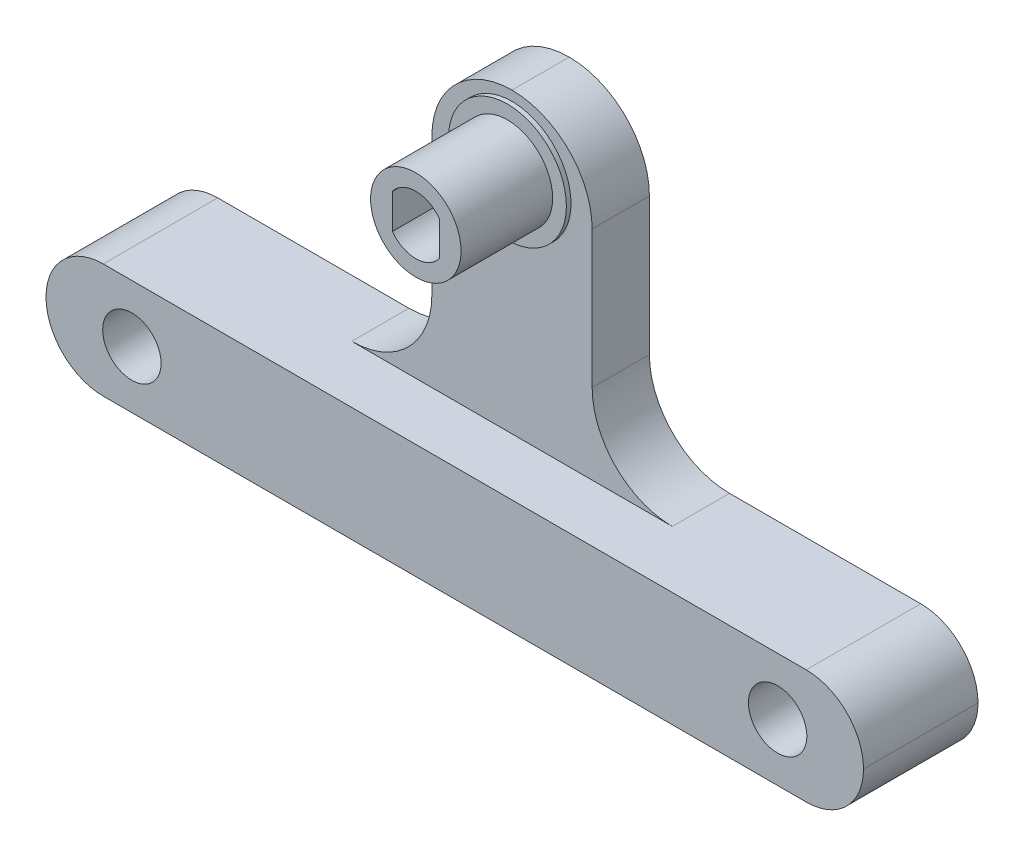
ISO-10303-21;
HEADER;
FILE_DESCRIPTION(('STEP AP214'),'2;1');
FILE_NAME('part.step','',(''),(''),'','','');
FILE_SCHEMA(('AUTOMOTIVE_DESIGN { 1 0 10303 214 1 1 1 1 }'));
ENDSEC;
DATA;
#1=APPLICATION_CONTEXT('core data for automotive mechanical design processes');
#2=APPLICATION_PROTOCOL_DEFINITION('international standard','automotive_design',2000,#1);
#3=PRODUCT_CONTEXT('',#1,'mechanical');
#4=PRODUCT('Part','Part','',(#3));
#5=PRODUCT_RELATED_PRODUCT_CATEGORY('part','',(#4));
#6=PRODUCT_DEFINITION_FORMATION('','',#4);
#7=PRODUCT_DEFINITION_CONTEXT('part definition',#1,'design');
#8=PRODUCT_DEFINITION('design','',#6,#7);
#9=PRODUCT_DEFINITION_SHAPE('','',#8);
#10=(LENGTH_UNIT() NAMED_UNIT(*) SI_UNIT(.MILLI.,.METRE.));
#11=(NAMED_UNIT(*) PLANE_ANGLE_UNIT() SI_UNIT($,.RADIAN.));
#12=(NAMED_UNIT(*) SI_UNIT($,.STERADIAN.) SOLID_ANGLE_UNIT());
#13=UNCERTAINTY_MEASURE_WITH_UNIT(LENGTH_MEASURE(1.E-05),#10,'distance_accuracy_value','');
#14=(GEOMETRIC_REPRESENTATION_CONTEXT(3) GLOBAL_UNCERTAINTY_ASSIGNED_CONTEXT((#13)) GLOBAL_UNIT_ASSIGNED_CONTEXT((#10,
#11,#12)) REPRESENTATION_CONTEXT('',''));
#15=CARTESIAN_POINT('',(0.,0.,0.));
#16=DIRECTION('',(0.,0.,1.));
#17=DIRECTION('',(1.,0.,0.));
#18=AXIS2_PLACEMENT_3D('',#15,#16,#17);
#19=CARTESIAN_POINT('',(0.,0.,-41.5));
#20=DIRECTION('',(0.,0.,-1.));
#21=DIRECTION('',(-1.,0.,0.));
#22=AXIS2_PLACEMENT_3D('',#19,#20,#21);
#23=PLANE('',#22);
#24=DIRECTION('',(0.,-1.,0.));
#25=VECTOR('',#24,1.);
#26=CARTESIAN_POINT('',(6.99999999999999,36.,-41.5));
#27=LINE('',#26,#25);
#28=CARTESIAN_POINT('',(6.99999999999999,29.,-41.5));
#29=VERTEX_POINT('',#28);
#30=CARTESIAN_POINT('',(6.99999999999999,17.,-41.5));
#31=VERTEX_POINT('',#30);
#32=EDGE_CURVE('E232',#29,#31,#27,.T.);
#33=ORIENTED_EDGE('',*,*,#32,.F.);
#34=CARTESIAN_POINT('',(0.,29.,-41.5));
#35=DIRECTION('',(0.,0.,-1.));
#36=DIRECTION('',(-1.,0.,0.));
#37=AXIS2_PLACEMENT_3D('',#34,#35,#36);
#38=CIRCLE('',#37,7.);
#39=CARTESIAN_POINT('',(0.,36.,-41.5));
#40=VERTEX_POINT('',#39);
#41=EDGE_CURVE('E276',#29,#40,#38,.F.);
#42=ORIENTED_EDGE('',*,*,#41,.T.);
#43=CARTESIAN_POINT('',(0.,29.,-41.5));
#44=DIRECTION('',(0.,0.,-1.));
#45=DIRECTION('',(-1.,0.,0.));
#46=AXIS2_PLACEMENT_3D('',#43,#44,#45);
#47=CIRCLE('',#46,7.);
#48=CARTESIAN_POINT('',(-7.00000000000001,29.,-41.5));
#49=VERTEX_POINT('',#48);
#50=EDGE_CURVE('E274',#40,#49,#47,.F.);
#51=ORIENTED_EDGE('',*,*,#50,.T.);
#52=DIRECTION('',(0.,1.,0.));
#53=VECTOR('',#52,1.);
#54=CARTESIAN_POINT('',(-7.,10.,-41.5));
#55=LINE('',#54,#53);
#56=CARTESIAN_POINT('',(-7.,17.,-41.5));
#57=VERTEX_POINT('',#56);
#58=EDGE_CURVE('E228',#57,#49,#55,.T.);
#59=ORIENTED_EDGE('',*,*,#58,.F.);
#60=CARTESIAN_POINT('',(-14.,17.,-41.5));
#61=DIRECTION('',(0.,0.,-1.));
#62=DIRECTION('',(-1.,0.,0.));
#63=AXIS2_PLACEMENT_3D('',#60,#61,#62);
#64=CIRCLE('',#63,7.);
#65=CARTESIAN_POINT('',(-14.,10.,-41.5));
#66=VERTEX_POINT('',#65);
#67=EDGE_CURVE('E285',#57,#66,#64,.T.);
#68=ORIENTED_EDGE('',*,*,#67,.T.);
#69=DIRECTION('',(-1.,0.,0.));
#70=VECTOR('',#69,1.);
#71=CARTESIAN_POINT('',(-7.,10.,-41.5));
#72=LINE('',#71,#70);
#73=CARTESIAN_POINT('',(14.,10.,-41.5));
#74=VERTEX_POINT('',#73);
#75=EDGE_CURVE('E226',#74,#66,#72,.T.);
#76=ORIENTED_EDGE('',*,*,#75,.F.);
#77=CARTESIAN_POINT('',(14.,17.,-41.5));
#78=DIRECTION('',(0.,0.,-1.));
#79=DIRECTION('',(-1.,0.,0.));
#80=AXIS2_PLACEMENT_3D('',#77,#78,#79);
#81=CIRCLE('',#80,7.);
#82=EDGE_CURVE('E281',#74,#31,#81,.T.);
#83=ORIENTED_EDGE('',*,*,#82,.T.);
#84=EDGE_LOOP('',(#33,#42,#51,#59,#68,#76,#83));
#85=FACE_BOUND('',#84,.T.);
#86=CARTESIAN_POINT('',(0.,30.,-41.5));
#87=DIRECTION('',(0.,0.,-1.));
#88=DIRECTION('',(-1.,0.,0.));
#89=AXIS2_PLACEMENT_3D('',#86,#87,#88);
#90=CIRCLE('',#89,5.15);
#91=CARTESIAN_POINT('',(-5.15000000000001,30.,-41.5));
#92=VERTEX_POINT('',#91);
#93=EDGE_CURVE('E248',#92,#92,#90,.F.);
#94=ORIENTED_EDGE('',*,*,#93,.F.);
#95=EDGE_LOOP('',(#94));
#96=FACE_BOUND('',#95,.T.);
#97=ADVANCED_FACE('F42',(#85,#96),#23,.F.);
#98=CARTESIAN_POINT('',(0.,10.,0.));
#99=DIRECTION('',(0.,1.,0.));
#100=DIRECTION('',(0.,0.,1.));
#101=AXIS2_PLACEMENT_3D('',#98,#99,#100);
#102=PLANE('',#101);
#103=DIRECTION('',(-1.,0.,0.));
#104=VECTOR('',#103,1.);
#105=CARTESIAN_POINT('',(-35.7,10.,-46.5));
#106=LINE('',#105,#104);
#107=CARTESIAN_POINT('',(-14.,10.,-46.5));
#108=VERTEX_POINT('',#107);
#109=CARTESIAN_POINT('',(-30.7,10.,-46.5));
#110=VERTEX_POINT('',#109);
#111=EDGE_CURVE('E249',#108,#110,#106,.T.);
#112=ORIENTED_EDGE('',*,*,#111,.T.);
#113=DIRECTION('',(0.,0.,1.));
#114=VECTOR('',#113,1.);
#115=CARTESIAN_POINT('',(-30.7,10.,-36.5));
#116=LINE('',#115,#114);
#117=CARTESIAN_POINT('',(-30.7,10.,-36.5));
#118=VERTEX_POINT('',#117);
#119=EDGE_CURVE('E297',#110,#118,#116,.T.);
#120=ORIENTED_EDGE('',*,*,#119,.T.);
#121=DIRECTION('',(-1.,0.,0.));
#122=VECTOR('',#121,1.);
#123=CARTESIAN_POINT('',(-25.7,10.,-36.5));
#124=LINE('',#123,#122);
#125=CARTESIAN_POINT('',(30.7,10.,-36.5));
#126=VERTEX_POINT('',#125);
#127=EDGE_CURVE('E240',#126,#118,#124,.T.);
#128=ORIENTED_EDGE('',*,*,#127,.F.);
#129=DIRECTION('',(0.,0.,-1.));
#130=VECTOR('',#129,1.);
#131=CARTESIAN_POINT('',(30.7,10.,-46.5));
#132=LINE('',#131,#130);
#133=CARTESIAN_POINT('',(30.7,10.,-46.5));
#134=VERTEX_POINT('',#133);
#135=EDGE_CURVE('E288',#126,#134,#132,.T.);
#136=ORIENTED_EDGE('',*,*,#135,.T.);
#137=CARTESIAN_POINT('',(14.,10.,-46.5));
#138=VERTEX_POINT('',#137);
#139=EDGE_CURVE('E246',#134,#138,#106,.T.);
#140=ORIENTED_EDGE('',*,*,#139,.T.);
#141=DIRECTION('',(0.,0.,-1.));
#142=VECTOR('',#141,1.);
#143=CARTESIAN_POINT('',(14.,10.,-41.5));
#144=LINE('',#143,#142);
#145=EDGE_CURVE('E263',#138,#74,#144,.F.);
#146=ORIENTED_EDGE('',*,*,#145,.T.);
#147=ORIENTED_EDGE('',*,*,#75,.T.);
#148=DIRECTION('',(0.,0.,-1.));
#149=VECTOR('',#148,1.);
#150=CARTESIAN_POINT('',(-14.,10.,-46.5));
#151=LINE('',#150,#149);
#152=EDGE_CURVE('E260',#66,#108,#151,.T.);
#153=ORIENTED_EDGE('',*,*,#152,.T.);
#154=EDGE_LOOP('',(#112,#120,#128,#136,#140,#146,#147,#153));
#155=FACE_BOUND('',#154,.T.);
#156=ADVANCED_FACE('F402',(#155),#102,.T.);
#157=CARTESIAN_POINT('',(0.,0.,0.));
#158=DIRECTION('',(0.,1.,0.));
#159=DIRECTION('',(0.,0.,1.));
#160=AXIS2_PLACEMENT_3D('',#157,#158,#159);
#161=PLANE('',#160);
#162=DIRECTION('',(-1.,0.,0.));
#163=VECTOR('',#162,1.);
#164=CARTESIAN_POINT('',(-25.7,0.,-36.5));
#165=LINE('',#164,#163);
#166=CARTESIAN_POINT('',(30.7,0.,-36.5));
#167=VERTEX_POINT('',#166);
#168=CARTESIAN_POINT('',(-30.7,0.,-36.5));
#169=VERTEX_POINT('',#168);
#170=EDGE_CURVE('E235',#167,#169,#165,.T.);
#171=ORIENTED_EDGE('',*,*,#170,.T.);
#172=DIRECTION('',(0.,0.,1.));
#173=VECTOR('',#172,1.);
#174=CARTESIAN_POINT('',(-30.7,0.,0.));
#175=LINE('',#174,#173);
#176=CARTESIAN_POINT('',(-30.7,0.,-46.5));
#177=VERTEX_POINT('',#176);
#178=EDGE_CURVE('E319',#169,#177,#175,.F.);
#179=ORIENTED_EDGE('',*,*,#178,.T.);
#180=DIRECTION('',(-1.,0.,0.));
#181=VECTOR('',#180,1.);
#182=CARTESIAN_POINT('',(-35.7,0.,-46.5));
#183=LINE('',#182,#181);
#184=CARTESIAN_POINT('',(30.7,0.,-46.5));
#185=VERTEX_POINT('',#184);
#186=EDGE_CURVE('E243',#185,#177,#183,.T.);
#187=ORIENTED_EDGE('',*,*,#186,.F.);
#188=DIRECTION('',(0.,0.,-1.));
#189=VECTOR('',#188,1.);
#190=CARTESIAN_POINT('',(30.7,0.,0.));
#191=LINE('',#190,#189);
#192=EDGE_CURVE('E316',#185,#167,#191,.F.);
#193=ORIENTED_EDGE('',*,*,#192,.T.);
#194=EDGE_LOOP('',(#171,#179,#187,#193));
#195=FACE_BOUND('',#194,.T.);
#196=ADVANCED_FACE('F408',(#195),#161,.F.);
#197=CARTESIAN_POINT('',(-35.7,10.,-46.5));
#198=DIRECTION('',(0.,0.,1.));
#199=DIRECTION('',(1.,0.,0.));
#200=AXIS2_PLACEMENT_3D('',#197,#198,#199);
#201=PLANE('',#200);
#202=CARTESIAN_POINT('',(0.,30.,-46.5));
#203=DIRECTION('',(0.,0.,1.));
#204=DIRECTION('',(1.,0.,0.));
#205=AXIS2_PLACEMENT_3D('',#202,#203,#204);
#206=CIRCLE('',#205,3.05);
#207=CARTESIAN_POINT('',(2.54999999999998,31.6733200530682,-46.5));
#208=VERTEX_POINT('',#207);
#209=CARTESIAN_POINT('',(-2.55000000000001,31.6733200530681,-46.5));
#210=VERTEX_POINT('',#209);
#211=EDGE_CURVE('E332',#208,#210,#206,.T.);
#212=ORIENTED_EDGE('',*,*,#211,.T.);
#213=DIRECTION('',(0.,-1.,0.));
#214=VECTOR('',#213,1.);
#215=CARTESIAN_POINT('',(-2.55000000000001,10.,-46.5));
#216=LINE('',#215,#214);
#217=CARTESIAN_POINT('',(-2.55000000000001,28.3266799469319,-46.5));
#218=VERTEX_POINT('',#217);
#219=EDGE_CURVE('E334',#210,#218,#216,.T.);
#220=ORIENTED_EDGE('',*,*,#219,.T.);
#221=CARTESIAN_POINT('',(0.,30.,-46.5));
#222=DIRECTION('',(0.,0.,1.));
#223=DIRECTION('',(1.,0.,0.));
#224=AXIS2_PLACEMENT_3D('',#221,#222,#223);
#225=CIRCLE('',#224,3.05);
#226=CARTESIAN_POINT('',(2.54999999999998,28.3266799469318,-46.5));
#227=VERTEX_POINT('',#226);
#228=EDGE_CURVE('E328',#218,#227,#225,.T.);
#229=ORIENTED_EDGE('',*,*,#228,.T.);
#230=DIRECTION('',(0.,1.,0.));
#231=VECTOR('',#230,1.);
#232=CARTESIAN_POINT('',(2.54999999999998,10.,-46.5));
#233=LINE('',#232,#231);
#234=EDGE_CURVE('E330',#227,#208,#233,.T.);
#235=ORIENTED_EDGE('',*,*,#234,.T.);
#236=EDGE_LOOP('',(#212,#220,#229,#235));
#237=FACE_BOUND('',#236,.T.);
#238=CARTESIAN_POINT('',(28.2,5.,-46.5));
#239=DIRECTION('',(0.,0.,-1.));
#240=DIRECTION('',(-1.,0.,0.));
#241=AXIS2_PLACEMENT_3D('',#238,#239,#240);
#242=CIRCLE('',#241,2.55);
#243=CARTESIAN_POINT('',(25.65,5.,-46.5));
#244=VERTEX_POINT('',#243);
#245=EDGE_CURVE('E207',#244,#244,#242,.T.);
#246=ORIENTED_EDGE('',*,*,#245,.F.);
#247=EDGE_LOOP('',(#246));
#248=FACE_BOUND('',#247,.T.);
#249=CARTESIAN_POINT('',(-28.2,5.,-46.5));
#250=DIRECTION('',(0.,0.,-1.));
#251=DIRECTION('',(-1.,0.,0.));
#252=AXIS2_PLACEMENT_3D('',#249,#250,#251);
#253=CIRCLE('',#252,2.55);
#254=CARTESIAN_POINT('',(-30.75,5.,-46.5));
#255=VERTEX_POINT('',#254);
#256=EDGE_CURVE('E211',#255,#255,#253,.T.);
#257=ORIENTED_EDGE('',*,*,#256,.F.);
#258=EDGE_LOOP('',(#257));
#259=FACE_BOUND('',#258,.T.);
#260=CARTESIAN_POINT('',(-30.7,5.,-46.5));
#261=DIRECTION('',(0.,0.,1.));
#262=DIRECTION('',(1.,0.,0.));
#263=AXIS2_PLACEMENT_3D('',#260,#261,#262);
#264=CIRCLE('',#263,5.);
#265=CARTESIAN_POINT('',(-35.7,5.,-46.5));
#266=VERTEX_POINT('',#265);
#267=EDGE_CURVE('E312',#177,#266,#264,.F.);
#268=ORIENTED_EDGE('',*,*,#267,.T.);
#269=CARTESIAN_POINT('',(-30.7,5.,-46.5));
#270=DIRECTION('',(0.,0.,1.));
#271=DIRECTION('',(1.,0.,0.));
#272=AXIS2_PLACEMENT_3D('',#269,#270,#271);
#273=CIRCLE('',#272,5.);
#274=EDGE_CURVE('E314',#266,#110,#273,.F.);
#275=ORIENTED_EDGE('',*,*,#274,.T.);
#276=ORIENTED_EDGE('',*,*,#111,.F.);
#277=CARTESIAN_POINT('',(-14.,17.,-46.5));
#278=DIRECTION('',(0.,0.,1.));
#279=DIRECTION('',(1.,0.,0.));
#280=AXIS2_PLACEMENT_3D('',#277,#278,#279);
#281=CIRCLE('',#280,7.);
#282=CARTESIAN_POINT('',(-7.00000000000001,17.,-46.5));
#283=VERTEX_POINT('',#282);
#284=EDGE_CURVE('E283',#108,#283,#281,.T.);
#285=ORIENTED_EDGE('',*,*,#284,.T.);
#286=DIRECTION('',(0.,1.,0.));
#287=VECTOR('',#286,1.);
#288=CARTESIAN_POINT('',(-7.,10.,-46.5));
#289=LINE('',#288,#287);
#290=CARTESIAN_POINT('',(-7.00000000000001,29.,-46.5));
#291=VERTEX_POINT('',#290);
#292=EDGE_CURVE('E225',#283,#291,#289,.T.);
#293=ORIENTED_EDGE('',*,*,#292,.T.);
#294=CARTESIAN_POINT('',(0.,29.,-46.5));
#295=DIRECTION('',(0.,0.,1.));
#296=DIRECTION('',(1.,0.,0.));
#297=AXIS2_PLACEMENT_3D('',#294,#295,#296);
#298=CIRCLE('',#297,7.);
#299=CARTESIAN_POINT('',(0.,36.,-46.5));
#300=VERTEX_POINT('',#299);
#301=EDGE_CURVE('E270',#291,#300,#298,.F.);
#302=ORIENTED_EDGE('',*,*,#301,.T.);
#303=CARTESIAN_POINT('',(0.,29.,-46.5));
#304=DIRECTION('',(0.,0.,1.));
#305=DIRECTION('',(1.,0.,0.));
#306=AXIS2_PLACEMENT_3D('',#303,#304,#305);
#307=CIRCLE('',#306,7.);
#308=CARTESIAN_POINT('',(6.99999999999999,29.,-46.5));
#309=VERTEX_POINT('',#308);
#310=EDGE_CURVE('E272',#300,#309,#307,.F.);
#311=ORIENTED_EDGE('',*,*,#310,.T.);
#312=DIRECTION('',(0.,-1.,0.));
#313=VECTOR('',#312,1.);
#314=CARTESIAN_POINT('',(6.99999999999999,36.,-46.5));
#315=LINE('',#314,#313);
#316=CARTESIAN_POINT('',(6.99999999999999,17.,-46.5));
#317=VERTEX_POINT('',#316);
#318=EDGE_CURVE('E229',#309,#317,#315,.T.);
#319=ORIENTED_EDGE('',*,*,#318,.T.);
#320=CARTESIAN_POINT('',(14.,17.,-46.5));
#321=DIRECTION('',(0.,0.,1.));
#322=DIRECTION('',(1.,0.,0.));
#323=AXIS2_PLACEMENT_3D('',#320,#321,#322);
#324=CIRCLE('',#323,7.);
#325=EDGE_CURVE('E278',#317,#138,#324,.T.);
#326=ORIENTED_EDGE('',*,*,#325,.T.);
#327=ORIENTED_EDGE('',*,*,#139,.F.);
#328=CARTESIAN_POINT('',(30.7,5.,-46.5));
#329=DIRECTION('',(0.,0.,1.));
#330=DIRECTION('',(1.,0.,0.));
#331=AXIS2_PLACEMENT_3D('',#328,#329,#330);
#332=CIRCLE('',#331,5.);
#333=CARTESIAN_POINT('',(35.7,5.,-46.5));
#334=VERTEX_POINT('',#333);
#335=EDGE_CURVE('E308',#134,#334,#332,.F.);
#336=ORIENTED_EDGE('',*,*,#335,.T.);
#337=CARTESIAN_POINT('',(30.7,5.,-46.5));
#338=DIRECTION('',(0.,0.,1.));
#339=DIRECTION('',(1.,0.,0.));
#340=AXIS2_PLACEMENT_3D('',#337,#338,#339);
#341=CIRCLE('',#340,5.);
#342=EDGE_CURVE('E310',#334,#185,#341,.F.);
#343=ORIENTED_EDGE('',*,*,#342,.T.);
#344=ORIENTED_EDGE('',*,*,#186,.T.);
#345=EDGE_LOOP('',(#268,#275,#276,#285,#293,#302,#311,#319,#326,#327,#336,#343,#344));
#346=FACE_BOUND('',#345,.T.);
#347=ADVANCED_FACE('F387',(#237,#248,#259,#346),#201,.F.);
#348=CARTESIAN_POINT('',(-25.7,10.,-36.5));
#349=DIRECTION('',(0.,0.,1.));
#350=DIRECTION('',(1.,0.,0.));
#351=AXIS2_PLACEMENT_3D('',#348,#349,#350);
#352=PLANE('',#351);
#353=CARTESIAN_POINT('',(28.2,5.,-36.5));
#354=DIRECTION('',(0.,0.,1.));
#355=DIRECTION('',(1.,0.,0.));
#356=AXIS2_PLACEMENT_3D('',#353,#354,#355);
#357=CIRCLE('',#356,2.55);
#358=CARTESIAN_POINT('',(25.65,5.,-36.5));
#359=VERTEX_POINT('',#358);
#360=EDGE_CURVE('E291',#359,#359,#357,.T.);
#361=ORIENTED_EDGE('',*,*,#360,.F.);
#362=EDGE_LOOP('',(#361));
#363=FACE_BOUND('',#362,.T.);
#364=CARTESIAN_POINT('',(-28.2,5.,-36.5));
#365=DIRECTION('',(0.,0.,1.));
#366=DIRECTION('',(1.,0.,0.));
#367=AXIS2_PLACEMENT_3D('',#364,#365,#366);
#368=CIRCLE('',#367,2.55);
#369=CARTESIAN_POINT('',(-30.75,5.,-36.5));
#370=VERTEX_POINT('',#369);
#371=EDGE_CURVE('E210',#370,#370,#368,.T.);
#372=ORIENTED_EDGE('',*,*,#371,.F.);
#373=EDGE_LOOP('',(#372));
#374=FACE_BOUND('',#373,.T.);
#375=ORIENTED_EDGE('',*,*,#127,.T.);
#376=CARTESIAN_POINT('',(-30.7,5.,-36.5));
#377=DIRECTION('',(0.,0.,1.));
#378=DIRECTION('',(1.,0.,0.));
#379=AXIS2_PLACEMENT_3D('',#376,#377,#378);
#380=CIRCLE('',#379,5.);
#381=CARTESIAN_POINT('',(-35.7,5.,-36.5));
#382=VERTEX_POINT('',#381);
#383=EDGE_CURVE('E306',#118,#382,#380,.T.);
#384=ORIENTED_EDGE('',*,*,#383,.T.);
#385=CARTESIAN_POINT('',(-30.7,5.,-36.5));
#386=DIRECTION('',(0.,0.,1.));
#387=DIRECTION('',(1.,0.,0.));
#388=AXIS2_PLACEMENT_3D('',#385,#386,#387);
#389=CIRCLE('',#388,5.);
#390=EDGE_CURVE('E304',#382,#169,#389,.T.);
#391=ORIENTED_EDGE('',*,*,#390,.T.);
#392=ORIENTED_EDGE('',*,*,#170,.F.);
#393=CARTESIAN_POINT('',(30.7,5.,-36.5));
#394=DIRECTION('',(0.,0.,1.));
#395=DIRECTION('',(1.,0.,0.));
#396=AXIS2_PLACEMENT_3D('',#393,#394,#395);
#397=CIRCLE('',#396,5.);
#398=CARTESIAN_POINT('',(35.7,5.,-36.5));
#399=VERTEX_POINT('',#398);
#400=EDGE_CURVE('E302',#167,#399,#397,.T.);
#401=ORIENTED_EDGE('',*,*,#400,.T.);
#402=CARTESIAN_POINT('',(30.7,5.,-36.5));
#403=DIRECTION('',(0.,0.,1.));
#404=DIRECTION('',(1.,0.,0.));
#405=AXIS2_PLACEMENT_3D('',#402,#403,#404);
#406=CIRCLE('',#405,5.);
#407=EDGE_CURVE('E300',#399,#126,#406,.T.);
#408=ORIENTED_EDGE('',*,*,#407,.T.);
#409=EDGE_LOOP('',(#375,#384,#391,#392,#401,#408));
#410=FACE_BOUND('',#409,.T.);
#411=ADVANCED_FACE('F421',(#363,#374,#410),#352,.T.);
#412=CARTESIAN_POINT('',(6.99999999999999,36.,-41.5));
#413=DIRECTION('',(1.,0.,0.));
#414=DIRECTION('',(0.,0.,-1.));
#415=AXIS2_PLACEMENT_3D('',#412,#413,#414);
#416=PLANE('',#415);
#417=ORIENTED_EDGE('',*,*,#32,.T.);
#418=DIRECTION('',(0.,0.,-1.));
#419=VECTOR('',#418,1.);
#420=CARTESIAN_POINT('',(6.99999999999999,17.,-46.5));
#421=LINE('',#420,#419);
#422=EDGE_CURVE('E257',#31,#317,#421,.T.);
#423=ORIENTED_EDGE('',*,*,#422,.T.);
#424=ORIENTED_EDGE('',*,*,#318,.F.);
#425=DIRECTION('',(0.,0.,-1.));
#426=VECTOR('',#425,1.);
#427=CARTESIAN_POINT('',(6.99999999999999,29.,-41.5));
#428=LINE('',#427,#426);
#429=EDGE_CURVE('E254',#309,#29,#428,.F.);
#430=ORIENTED_EDGE('',*,*,#429,.T.);
#431=EDGE_LOOP('',(#417,#423,#424,#430));
#432=FACE_BOUND('',#431,.T.);
#433=ADVANCED_FACE('F417',(#432),#416,.T.);
#434=CARTESIAN_POINT('',(-7.,10.,-41.5));
#435=DIRECTION('',(-1.,0.,0.));
#436=DIRECTION('',(0.,0.,1.));
#437=AXIS2_PLACEMENT_3D('',#434,#435,#436);
#438=PLANE('',#437);
#439=ORIENTED_EDGE('',*,*,#292,.F.);
#440=DIRECTION('',(0.,0.,-1.));
#441=VECTOR('',#440,1.);
#442=CARTESIAN_POINT('',(-7.,17.,-41.5));
#443=LINE('',#442,#441);
#444=EDGE_CURVE('E268',#283,#57,#443,.F.);
#445=ORIENTED_EDGE('',*,*,#444,.T.);
#446=ORIENTED_EDGE('',*,*,#58,.T.);
#447=DIRECTION('',(0.,0.,-1.));
#448=VECTOR('',#447,1.);
#449=CARTESIAN_POINT('',(-7.00000000000001,29.,-41.5));
#450=LINE('',#449,#448);
#451=EDGE_CURVE('E266',#49,#291,#450,.T.);
#452=ORIENTED_EDGE('',*,*,#451,.T.);
#453=EDGE_LOOP('',(#439,#445,#446,#452));
#454=FACE_BOUND('',#453,.T.);
#455=ADVANCED_FACE('F420',(#454),#438,.T.);
#456=CARTESIAN_POINT('',(0.,30.,-33.1));
#457=DIRECTION('',(0.,0.,1.));
#458=DIRECTION('',(1.,0.,0.));
#459=AXIS2_PLACEMENT_3D('',#456,#457,#458);
#460=PLANE('',#459);
#461=CARTESIAN_POINT('',(0.,30.,-33.1));
#462=DIRECTION('',(0.,0.,1.));
#463=DIRECTION('',(1.,0.,0.));
#464=AXIS2_PLACEMENT_3D('',#461,#462,#463);
#465=CIRCLE('',#464,3.95);
#466=CARTESIAN_POINT('',(3.94999999999999,30.,-33.1));
#467=VERTEX_POINT('',#466);
#468=EDGE_CURVE('E222',#467,#467,#465,.T.);
#469=ORIENTED_EDGE('',*,*,#468,.T.);
#470=EDGE_LOOP('',(#469));
#471=FACE_BOUND('',#470,.T.);
#472=DIRECTION('',(0.,1.,0.));
#473=VECTOR('',#472,1.);
#474=CARTESIAN_POINT('',(-2.05000000000001,28.4834249111897,-33.1));
#475=LINE('',#474,#473);
#476=CARTESIAN_POINT('',(-2.05000000000001,28.4834249111897,-33.1));
#477=VERTEX_POINT('',#476);
#478=CARTESIAN_POINT('',(-2.05000000000001,31.5165750888103,-33.1));
#479=VERTEX_POINT('',#478);
#480=EDGE_CURVE('E183',#477,#479,#475,.T.);
#481=ORIENTED_EDGE('',*,*,#480,.T.);
#482=CARTESIAN_POINT('',(0.,30.,-33.1));
#483=DIRECTION('',(0.,0.,1.));
#484=DIRECTION('',(1.,0.,0.));
#485=AXIS2_PLACEMENT_3D('',#482,#483,#484);
#486=CIRCLE('',#485,2.55);
#487=CARTESIAN_POINT('',(2.04999999999999,31.5165750888103,-33.1));
#488=VERTEX_POINT('',#487);
#489=EDGE_CURVE('E181',#479,#488,#486,.F.);
#490=ORIENTED_EDGE('',*,*,#489,.T.);
#491=DIRECTION('',(0.,-1.,0.));
#492=VECTOR('',#491,1.);
#493=CARTESIAN_POINT('',(2.04999999999999,31.5165750888103,-33.1));
#494=LINE('',#493,#492);
#495=CARTESIAN_POINT('',(2.04999999999999,28.4834249111897,-33.1));
#496=VERTEX_POINT('',#495);
#497=EDGE_CURVE('E187',#488,#496,#494,.T.);
#498=ORIENTED_EDGE('',*,*,#497,.T.);
#499=CARTESIAN_POINT('',(0.,30.,-33.1));
#500=DIRECTION('',(0.,0.,1.));
#501=DIRECTION('',(1.,0.,0.));
#502=AXIS2_PLACEMENT_3D('',#499,#500,#501);
#503=CIRCLE('',#502,2.55);
#504=EDGE_CURVE('E192',#496,#477,#503,.F.);
#505=ORIENTED_EDGE('',*,*,#504,.T.);
#506=EDGE_LOOP('',(#481,#490,#498,#505));
#507=FACE_BOUND('',#506,.T.);
#508=ADVANCED_FACE('F195',(#471,#507),#460,.T.);
#509=CARTESIAN_POINT('',(0.,30.,-33.1));
#510=DIRECTION('',(0.,0.,-1.));
#511=DIRECTION('',(-1.,0.,0.));
#512=AXIS2_PLACEMENT_3D('',#509,#510,#511);
#513=CYLINDRICAL_SURFACE('',#512,3.95);
#514=CARTESIAN_POINT('',(0.,30.,-41.1));
#515=DIRECTION('',(0.,0.,1.));
#516=DIRECTION('',(1.,0.,0.));
#517=AXIS2_PLACEMENT_3D('',#514,#515,#516);
#518=CIRCLE('',#517,3.95);
#519=CARTESIAN_POINT('',(3.94999999999999,30.,-41.1));
#520=VERTEX_POINT('',#519);
#521=EDGE_CURVE('E215',#520,#520,#518,.T.);
#522=ORIENTED_EDGE('',*,*,#521,.T.);
#523=EDGE_LOOP('',(#522));
#524=FACE_BOUND('',#523,.T.);
#525=ORIENTED_EDGE('',*,*,#468,.F.);
#526=EDGE_LOOP('',(#525));
#527=FACE_BOUND('',#526,.T.);
#528=ADVANCED_FACE('F415',(#524,#527),#513,.T.);
#529=CARTESIAN_POINT('',(0.,30.,-41.1));
#530=DIRECTION('',(0.,0.,1.));
#531=DIRECTION('',(1.,0.,0.));
#532=AXIS2_PLACEMENT_3D('',#529,#530,#531);
#533=PLANE('',#532);
#534=CARTESIAN_POINT('',(0.,30.,-41.1));
#535=DIRECTION('',(0.,0.,1.));
#536=DIRECTION('',(1.,0.,0.));
#537=AXIS2_PLACEMENT_3D('',#534,#535,#536);
#538=CIRCLE('',#537,5.15);
#539=CARTESIAN_POINT('',(5.14999999999999,30.,-41.1));
#540=VERTEX_POINT('',#539);
#541=EDGE_CURVE('E218',#540,#540,#538,.T.);
#542=ORIENTED_EDGE('',*,*,#541,.T.);
#543=EDGE_LOOP('',(#542));
#544=FACE_BOUND('',#543,.T.);
#545=ORIENTED_EDGE('',*,*,#521,.F.);
#546=EDGE_LOOP('',(#545));
#547=FACE_BOUND('',#546,.T.);
#548=ADVANCED_FACE('F652',(#544,#547),#533,.T.);
#549=CARTESIAN_POINT('',(0.,30.,-41.1));
#550=DIRECTION('',(0.,0.,-1.));
#551=DIRECTION('',(-1.,0.,0.));
#552=AXIS2_PLACEMENT_3D('',#549,#550,#551);
#553=CYLINDRICAL_SURFACE('',#552,5.15);
#554=ORIENTED_EDGE('',*,*,#541,.F.);
#555=EDGE_LOOP('',(#554));
#556=FACE_BOUND('',#555,.T.);
#557=ORIENTED_EDGE('',*,*,#93,.T.);
#558=EDGE_LOOP('',(#557));
#559=FACE_BOUND('',#558,.T.);
#560=ADVANCED_FACE('F438',(#556,#559),#553,.T.);
#561=CARTESIAN_POINT('',(14.,17.,-41.5));
#562=DIRECTION('',(0.,0.,1.));
#563=DIRECTION('',(1.,0.,0.));
#564=AXIS2_PLACEMENT_3D('',#561,#562,#563);
#565=CYLINDRICAL_SURFACE('',#564,7.);
#566=ORIENTED_EDGE('',*,*,#82,.F.);
#567=ORIENTED_EDGE('',*,*,#145,.F.);
#568=ORIENTED_EDGE('',*,*,#325,.F.);
#569=ORIENTED_EDGE('',*,*,#422,.F.);
#570=EDGE_LOOP('',(#566,#567,#568,#569));
#571=FACE_BOUND('',#570,.T.);
#572=ADVANCED_FACE('F434',(#571),#565,.F.);
#573=CARTESIAN_POINT('',(-14.,17.,0.));
#574=DIRECTION('',(0.,0.,1.));
#575=DIRECTION('',(1.,0.,0.));
#576=AXIS2_PLACEMENT_3D('',#573,#574,#575);
#577=CYLINDRICAL_SURFACE('',#576,7.);
#578=ORIENTED_EDGE('',*,*,#67,.F.);
#579=ORIENTED_EDGE('',*,*,#444,.F.);
#580=ORIENTED_EDGE('',*,*,#284,.F.);
#581=ORIENTED_EDGE('',*,*,#152,.F.);
#582=EDGE_LOOP('',(#578,#579,#580,#581));
#583=FACE_BOUND('',#582,.T.);
#584=ADVANCED_FACE('F437',(#583),#577,.F.);
#585=CARTESIAN_POINT('',(0.,29.,-41.5));
#586=DIRECTION('',(0.,0.,-1.));
#587=DIRECTION('',(-1.,0.,0.));
#588=AXIS2_PLACEMENT_3D('',#585,#586,#587);
#589=CYLINDRICAL_SURFACE('',#588,7.);
#590=ORIENTED_EDGE('',*,*,#451,.F.);
#591=ORIENTED_EDGE('',*,*,#50,.F.);
#592=DIRECTION('',(0.,0.,-1.));
#593=VECTOR('',#592,1.);
#594=CARTESIAN_POINT('',(0.,36.,-41.5));
#595=LINE('',#594,#593);
#596=EDGE_CURVE('E219',#300,#40,#595,.F.);
#597=ORIENTED_EDGE('',*,*,#596,.F.);
#598=ORIENTED_EDGE('',*,*,#301,.F.);
#599=EDGE_LOOP('',(#590,#591,#597,#598));
#600=FACE_BOUND('',#599,.T.);
#601=ADVANCED_FACE('F442',(#600),#589,.T.);
#602=CARTESIAN_POINT('',(0.,29.,-41.5));
#603=DIRECTION('',(0.,0.,-1.));
#604=DIRECTION('',(-1.,0.,0.));
#605=AXIS2_PLACEMENT_3D('',#602,#603,#604);
#606=CYLINDRICAL_SURFACE('',#605,7.);
#607=ORIENTED_EDGE('',*,*,#41,.F.);
#608=ORIENTED_EDGE('',*,*,#429,.F.);
#609=ORIENTED_EDGE('',*,*,#310,.F.);
#610=ORIENTED_EDGE('',*,*,#596,.T.);
#611=EDGE_LOOP('',(#607,#608,#609,#610));
#612=FACE_BOUND('',#611,.T.);
#613=ADVANCED_FACE('F444',(#612),#606,.T.);
#614=CARTESIAN_POINT('',(-28.2,5.,-33.1));
#615=DIRECTION('',(0.,0.,-1.));
#616=DIRECTION('',(-1.,0.,0.));
#617=AXIS2_PLACEMENT_3D('',#614,#615,#616);
#618=CYLINDRICAL_SURFACE('',#617,2.55);
#619=CARTESIAN_POINT('',(-30.75,5.,-36.5));
#620=CARTESIAN_POINT('',(-30.75,5.,-36.6041666666667));
#621=CARTESIAN_POINT('',(-30.75,5.,-36.7083333333333));
#622=CARTESIAN_POINT('',(-30.75,5.,-36.9166666666667));
#623=CARTESIAN_POINT('',(-30.75,5.,-37.0208333333333));
#624=CARTESIAN_POINT('',(-30.75,5.,-37.2291666666667));
#625=CARTESIAN_POINT('',(-30.75,5.,-37.3333333333333));
#626=CARTESIAN_POINT('',(-30.75,5.,-37.5416666666667));
#627=CARTESIAN_POINT('',(-30.75,5.,-37.6458333333333));
#628=CARTESIAN_POINT('',(-30.75,5.,-37.8541666666667));
#629=CARTESIAN_POINT('',(-30.75,5.,-37.9583333333333));
#630=CARTESIAN_POINT('',(-30.75,5.,-38.1666666666667));
#631=CARTESIAN_POINT('',(-30.75,5.,-38.2708333333333));
#632=CARTESIAN_POINT('',(-30.75,5.,-38.4791666666667));
#633=CARTESIAN_POINT('',(-30.75,5.,-38.5833333333333));
#634=CARTESIAN_POINT('',(-30.75,5.,-38.7916666666667));
#635=CARTESIAN_POINT('',(-30.75,5.,-38.8958333333333));
#636=CARTESIAN_POINT('',(-30.75,5.,-39.1041666666667));
#637=CARTESIAN_POINT('',(-30.75,5.,-39.2083333333333));
#638=CARTESIAN_POINT('',(-30.75,5.,-39.4166666666667));
#639=CARTESIAN_POINT('',(-30.75,5.,-39.5208333333333));
#640=CARTESIAN_POINT('',(-30.75,5.,-39.7291666666667));
#641=CARTESIAN_POINT('',(-30.75,5.,-39.8333333333333));
#642=CARTESIAN_POINT('',(-30.75,5.,-40.0416666666667));
#643=CARTESIAN_POINT('',(-30.75,5.,-40.1458333333333));
#644=CARTESIAN_POINT('',(-30.75,5.,-40.3541666666667));
#645=CARTESIAN_POINT('',(-30.75,5.,-40.4583333333333));
#646=CARTESIAN_POINT('',(-30.75,5.,-40.6666666666667));
#647=CARTESIAN_POINT('',(-30.75,5.,-40.7708333333333));
#648=CARTESIAN_POINT('',(-30.75,5.,-40.9791666666667));
#649=CARTESIAN_POINT('',(-30.75,5.,-41.0833333333333));
#650=CARTESIAN_POINT('',(-30.75,5.,-41.2916666666667));
#651=CARTESIAN_POINT('',(-30.75,5.,-41.3958333333333));
#652=CARTESIAN_POINT('',(-30.75,5.,-41.6041666666667));
#653=CARTESIAN_POINT('',(-30.75,5.,-41.7083333333333));
#654=CARTESIAN_POINT('',(-30.75,5.,-41.9166666666667));
#655=CARTESIAN_POINT('',(-30.75,5.,-42.0208333333333));
#656=CARTESIAN_POINT('',(-30.75,5.,-42.2291666666667));
#657=CARTESIAN_POINT('',(-30.75,5.,-42.3333333333333));
#658=CARTESIAN_POINT('',(-30.75,5.,-42.5416666666667));
#659=CARTESIAN_POINT('',(-30.75,5.,-42.6458333333333));
#660=CARTESIAN_POINT('',(-30.75,5.,-42.8541666666666));
#661=CARTESIAN_POINT('',(-30.75,5.,-42.9583333333333));
#662=CARTESIAN_POINT('',(-30.75,5.,-43.1666666666666));
#663=CARTESIAN_POINT('',(-30.75,5.,-43.2708333333333));
#664=CARTESIAN_POINT('',(-30.75,5.,-43.4791666666666));
#665=CARTESIAN_POINT('',(-30.75,5.,-43.5833333333333));
#666=CARTESIAN_POINT('',(-30.75,5.,-43.7916666666666));
#667=CARTESIAN_POINT('',(-30.75,5.,-43.8958333333333));
#668=CARTESIAN_POINT('',(-30.75,5.,-44.1041666666666));
#669=CARTESIAN_POINT('',(-30.75,5.,-44.2083333333333));
#670=CARTESIAN_POINT('',(-30.75,5.,-44.4166666666666));
#671=CARTESIAN_POINT('',(-30.75,5.,-44.5208333333333));
#672=CARTESIAN_POINT('',(-30.75,5.,-44.7291666666666));
#673=CARTESIAN_POINT('',(-30.75,5.,-44.8333333333333));
#674=CARTESIAN_POINT('',(-30.75,5.,-45.0416666666666));
#675=CARTESIAN_POINT('',(-30.75,5.,-45.1458333333333));
#676=CARTESIAN_POINT('',(-30.75,5.,-45.3541666666666));
#677=CARTESIAN_POINT('',(-30.75,5.,-45.4583333333333));
#678=CARTESIAN_POINT('',(-30.75,5.,-45.6666666666666));
#679=CARTESIAN_POINT('',(-30.75,5.,-45.7708333333333));
#680=CARTESIAN_POINT('',(-30.75,5.,-45.9791666666666));
#681=CARTESIAN_POINT('',(-30.75,5.,-46.0833333333333));
#682=CARTESIAN_POINT('',(-30.75,5.,-46.2916666666666));
#683=CARTESIAN_POINT('',(-30.75,5.,-46.3958333333333));
#684=CARTESIAN_POINT('',(-30.75,5.,-46.5));
#685=B_SPLINE_CURVE_WITH_KNOTS('',3,(#619,#620,#621,#622,#623,#624,#625,#626,#627,#628,#629,
#630,#631,#632,#633,#634,#635,#636,#637,#638,#639,#640,#641,#642,#643,#644,#645,#646,#647,#648,
#649,#650,#651,#652,#653,#654,#655,#656,#657,#658,#659,#660,#661,#662,#663,#664,#665,#666,#667,
#668,#669,#670,#671,#672,#673,#674,#675,#676,#677,#678,#679,#680,#681,#682,#683,#684),
.UNSPECIFIED.,.F.,.F.,(4,2,2,2,2,2,2,2,2,2,2,2,2,2,2,2,2,2,2,2,2,2,2,2,2,2,2,2,2,2,2,2,4),(0.,
0.3125,0.625000000000001,0.937500000000001,1.25,1.56249999999999,1.87499999999999,2.1875,2.5,
2.8125,3.125,3.43749999999999,3.74999999999999,4.06249999999999,4.37499999999999,
4.68749999999999,4.99999999999998,5.31249999999998,5.62499999999998,5.93749999999998,
6.24999999999998,6.56249999999998,6.87499999999998,7.18749999999998,7.49999999999998,
7.81249999999998,8.12499999999997,8.43749999999997,8.74999999999997,9.06249999999997,
9.37499999999997,9.68749999999997,9.99999999999997),.UNSPECIFIED.);
#686=EDGE_CURVE('BSEAM447',#370,#255,#685,.T.);
#687=ORIENTED_EDGE('',*,*,#371,.T.);
#688=ORIENTED_EDGE('',*,*,#256,.T.);
#689=ORIENTED_EDGE('',*,*,#686,.T.);
#690=ORIENTED_EDGE('',*,*,#686,.F.);
#691=EDGE_LOOP('',(#687,#689,#688,#690));
#692=FACE_BOUND('',#691,.T.);
#693=ADVANCED_FACE('F447',(#692),#618,.F.);
#694=CARTESIAN_POINT('',(28.2,5.,-33.1));
#695=DIRECTION('',(0.,0.,-1.));
#696=DIRECTION('',(-1.,0.,0.));
#697=AXIS2_PLACEMENT_3D('',#694,#695,#696);
#698=CYLINDRICAL_SURFACE('',#697,2.55);
#699=CARTESIAN_POINT('',(25.65,5.,-36.5));
#700=CARTESIAN_POINT('',(25.65,5.,-36.6041666666667));
#701=CARTESIAN_POINT('',(25.65,5.,-36.7083333333333));
#702=CARTESIAN_POINT('',(25.65,5.,-36.9166666666667));
#703=CARTESIAN_POINT('',(25.65,5.,-37.0208333333333));
#704=CARTESIAN_POINT('',(25.65,5.,-37.2291666666667));
#705=CARTESIAN_POINT('',(25.65,5.,-37.3333333333333));
#706=CARTESIAN_POINT('',(25.65,5.,-37.5416666666667));
#707=CARTESIAN_POINT('',(25.65,5.,-37.6458333333333));
#708=CARTESIAN_POINT('',(25.65,5.,-37.8541666666667));
#709=CARTESIAN_POINT('',(25.65,5.,-37.9583333333333));
#710=CARTESIAN_POINT('',(25.65,5.,-38.1666666666667));
#711=CARTESIAN_POINT('',(25.65,5.,-38.2708333333333));
#712=CARTESIAN_POINT('',(25.65,5.,-38.4791666666667));
#713=CARTESIAN_POINT('',(25.65,5.,-38.5833333333333));
#714=CARTESIAN_POINT('',(25.65,5.,-38.7916666666667));
#715=CARTESIAN_POINT('',(25.65,5.,-38.8958333333333));
#716=CARTESIAN_POINT('',(25.65,5.,-39.1041666666667));
#717=CARTESIAN_POINT('',(25.65,5.,-39.2083333333333));
#718=CARTESIAN_POINT('',(25.65,5.,-39.4166666666667));
#719=CARTESIAN_POINT('',(25.65,5.,-39.5208333333333));
#720=CARTESIAN_POINT('',(25.65,5.,-39.7291666666667));
#721=CARTESIAN_POINT('',(25.65,5.,-39.8333333333333));
#722=CARTESIAN_POINT('',(25.65,5.,-40.0416666666667));
#723=CARTESIAN_POINT('',(25.65,5.,-40.1458333333333));
#724=CARTESIAN_POINT('',(25.65,5.,-40.3541666666667));
#725=CARTESIAN_POINT('',(25.65,5.,-40.4583333333333));
#726=CARTESIAN_POINT('',(25.65,5.,-40.6666666666667));
#727=CARTESIAN_POINT('',(25.65,5.,-40.7708333333333));
#728=CARTESIAN_POINT('',(25.65,5.,-40.9791666666667));
#729=CARTESIAN_POINT('',(25.65,5.,-41.0833333333333));
#730=CARTESIAN_POINT('',(25.65,5.,-41.2916666666667));
#731=CARTESIAN_POINT('',(25.65,5.,-41.3958333333333));
#732=CARTESIAN_POINT('',(25.65,5.,-41.6041666666667));
#733=CARTESIAN_POINT('',(25.65,5.,-41.7083333333333));
#734=CARTESIAN_POINT('',(25.65,5.,-41.9166666666667));
#735=CARTESIAN_POINT('',(25.65,5.,-42.0208333333333));
#736=CARTESIAN_POINT('',(25.65,5.,-42.2291666666667));
#737=CARTESIAN_POINT('',(25.65,5.,-42.3333333333333));
#738=CARTESIAN_POINT('',(25.65,5.,-42.5416666666667));
#739=CARTESIAN_POINT('',(25.65,5.,-42.6458333333333));
#740=CARTESIAN_POINT('',(25.65,5.,-42.8541666666667));
#741=CARTESIAN_POINT('',(25.65,5.,-42.9583333333333));
#742=CARTESIAN_POINT('',(25.65,5.,-43.1666666666667));
#743=CARTESIAN_POINT('',(25.65,5.,-43.2708333333333));
#744=CARTESIAN_POINT('',(25.65,5.,-43.4791666666667));
#745=CARTESIAN_POINT('',(25.65,5.,-43.5833333333333));
#746=CARTESIAN_POINT('',(25.65,5.,-43.7916666666667));
#747=CARTESIAN_POINT('',(25.65,5.,-43.8958333333333));
#748=CARTESIAN_POINT('',(25.65,5.,-44.1041666666667));
#749=CARTESIAN_POINT('',(25.65,5.,-44.2083333333333));
#750=CARTESIAN_POINT('',(25.65,5.,-44.4166666666667));
#751=CARTESIAN_POINT('',(25.65,5.,-44.5208333333333));
#752=CARTESIAN_POINT('',(25.65,5.,-44.7291666666667));
#753=CARTESIAN_POINT('',(25.65,5.,-44.8333333333333));
#754=CARTESIAN_POINT('',(25.65,5.,-45.0416666666667));
#755=CARTESIAN_POINT('',(25.65,5.,-45.1458333333333));
#756=CARTESIAN_POINT('',(25.65,5.,-45.3541666666667));
#757=CARTESIAN_POINT('',(25.65,5.,-45.4583333333333));
#758=CARTESIAN_POINT('',(25.65,5.,-45.6666666666667));
#759=CARTESIAN_POINT('',(25.65,5.,-45.7708333333333));
#760=CARTESIAN_POINT('',(25.65,5.,-45.9791666666667));
#761=CARTESIAN_POINT('',(25.65,5.,-46.0833333333333));
#762=CARTESIAN_POINT('',(25.65,5.,-46.2916666666667));
#763=CARTESIAN_POINT('',(25.65,5.,-46.3958333333333));
#764=CARTESIAN_POINT('',(25.65,5.,-46.5));
#765=B_SPLINE_CURVE_WITH_KNOTS('',3,(#699,#700,#701,#702,#703,#704,#705,#706,#707,#708,#709,
#710,#711,#712,#713,#714,#715,#716,#717,#718,#719,#720,#721,#722,#723,#724,#725,#726,#727,#728,
#729,#730,#731,#732,#733,#734,#735,#736,#737,#738,#739,#740,#741,#742,#743,#744,#745,#746,#747,
#748,#749,#750,#751,#752,#753,#754,#755,#756,#757,#758,#759,#760,#761,#762,#763,#764),
.UNSPECIFIED.,.F.,.F.,(4,2,2,2,2,2,2,2,2,2,2,2,2,2,2,2,2,2,2,2,2,2,2,2,2,2,2,2,2,2,2,2,4),(0.,
0.3125,0.625000000000001,0.937500000000001,1.25,1.5625,1.875,2.1875,2.5,2.8125,3.125,3.4375,
3.75,4.0625,4.375,4.68749999999999,4.99999999999999,5.31249999999999,5.62499999999999,
5.93749999999999,6.24999999999999,6.56249999999999,6.87499999999998,7.18749999999999,
7.49999999999999,7.81249999999999,8.12499999999999,8.43749999999999,8.74999999999999,
9.06249999999999,9.37499999999999,9.68749999999998,9.99999999999998),.UNSPECIFIED.);
#766=EDGE_CURVE('BSEAM460',#359,#244,#765,.T.);
#767=ORIENTED_EDGE('',*,*,#360,.T.);
#768=ORIENTED_EDGE('',*,*,#245,.T.);
#769=ORIENTED_EDGE('',*,*,#766,.T.);
#770=ORIENTED_EDGE('',*,*,#766,.F.);
#771=EDGE_LOOP('',(#767,#769,#768,#770));
#772=FACE_BOUND('',#771,.T.);
#773=ADVANCED_FACE('F460',(#772),#698,.F.);
#774=CARTESIAN_POINT('',(-30.7,5.,-46.5));
#775=DIRECTION('',(0.,0.,1.));
#776=DIRECTION('',(1.,0.,0.));
#777=AXIS2_PLACEMENT_3D('',#774,#775,#776);
#778=CYLINDRICAL_SURFACE('',#777,5.);
#779=DIRECTION('',(0.,0.,1.));
#780=VECTOR('',#779,1.);
#781=CARTESIAN_POINT('',(-35.7,5.,-46.5));
#782=LINE('',#781,#780);
#783=EDGE_CURVE('E214',#266,#382,#782,.T.);
#784=ORIENTED_EDGE('',*,*,#783,.F.);
#785=ORIENTED_EDGE('',*,*,#267,.F.);
#786=ORIENTED_EDGE('',*,*,#178,.F.);
#787=ORIENTED_EDGE('',*,*,#390,.F.);
#788=EDGE_LOOP('',(#784,#785,#786,#787));
#789=FACE_BOUND('',#788,.T.);
#790=ADVANCED_FACE('F456',(#789),#778,.T.);
#791=CARTESIAN_POINT('',(-30.7,5.,0.));
#792=DIRECTION('',(0.,0.,-1.));
#793=DIRECTION('',(-1.,0.,0.));
#794=AXIS2_PLACEMENT_3D('',#791,#792,#793);
#795=CYLINDRICAL_SURFACE('',#794,5.);
#796=ORIENTED_EDGE('',*,*,#274,.F.);
#797=ORIENTED_EDGE('',*,*,#783,.T.);
#798=ORIENTED_EDGE('',*,*,#383,.F.);
#799=ORIENTED_EDGE('',*,*,#119,.F.);
#800=EDGE_LOOP('',(#796,#797,#798,#799));
#801=FACE_BOUND('',#800,.T.);
#802=ADVANCED_FACE('F452',(#801),#795,.T.);
#803=CARTESIAN_POINT('',(30.7,5.,0.));
#804=DIRECTION('',(0.,0.,1.));
#805=DIRECTION('',(1.,0.,0.));
#806=AXIS2_PLACEMENT_3D('',#803,#804,#805);
#807=CYLINDRICAL_SURFACE('',#806,5.);
#808=ORIENTED_EDGE('',*,*,#135,.F.);
#809=ORIENTED_EDGE('',*,*,#407,.F.);
#810=DIRECTION('',(0.,0.,-1.));
#811=VECTOR('',#810,1.);
#812=CARTESIAN_POINT('',(35.7,5.,-36.5));
#813=LINE('',#812,#811);
#814=EDGE_CURVE('E199',#334,#399,#813,.F.);
#815=ORIENTED_EDGE('',*,*,#814,.F.);
#816=ORIENTED_EDGE('',*,*,#335,.F.);
#817=EDGE_LOOP('',(#808,#809,#815,#816));
#818=FACE_BOUND('',#817,.T.);
#819=ADVANCED_FACE('F455',(#818),#807,.T.);
#820=CARTESIAN_POINT('',(30.7,5.,-46.5));
#821=DIRECTION('',(0.,0.,-1.));
#822=DIRECTION('',(-1.,0.,0.));
#823=AXIS2_PLACEMENT_3D('',#820,#821,#822);
#824=CYLINDRICAL_SURFACE('',#823,5.);
#825=ORIENTED_EDGE('',*,*,#400,.F.);
#826=ORIENTED_EDGE('',*,*,#192,.F.);
#827=ORIENTED_EDGE('',*,*,#342,.F.);
#828=ORIENTED_EDGE('',*,*,#814,.T.);
#829=EDGE_LOOP('',(#825,#826,#827,#828));
#830=FACE_BOUND('',#829,.T.);
#831=ADVANCED_FACE('F462',(#830),#824,.T.);
#832=CARTESIAN_POINT('',(0.,30.,-25.321825406948));
#833=DIRECTION('',(0.,0.,-1.));
#834=DIRECTION('',(-1.,0.,0.));
#835=AXIS2_PLACEMENT_3D('',#832,#833,#834);
#836=CYLINDRICAL_SURFACE('',#835,2.55);
#837=DIRECTION('',(0.,0.,-1.));
#838=VECTOR('',#837,1.);
#839=CARTESIAN_POINT('',(-2.05000000000001,31.5165750888103,-25.321825406948));
#840=LINE('',#839,#838);
#841=CARTESIAN_POINT('',(-2.05000000000001,31.5165750888103,-46.));
#842=VERTEX_POINT('',#841);
#843=EDGE_CURVE('E201',#479,#842,#840,.T.);
#844=ORIENTED_EDGE('',*,*,#843,.T.);
#845=CARTESIAN_POINT('',(0.,30.,-46.));
#846=DIRECTION('',(0.,0.,1.));
#847=DIRECTION('',(1.,0.,0.));
#848=AXIS2_PLACEMENT_3D('',#845,#846,#847);
#849=CIRCLE('',#848,2.55);
#850=CARTESIAN_POINT('',(2.04999999999999,31.5165750888103,-46.));
#851=VERTEX_POINT('',#850);
#852=EDGE_CURVE('E72',#842,#851,#849,.F.);
#853=ORIENTED_EDGE('',*,*,#852,.T.);
#854=DIRECTION('',(0.,0.,-1.));
#855=VECTOR('',#854,1.);
#856=CARTESIAN_POINT('',(2.04999999999999,31.5165750888103,-25.321825406948));
#857=LINE('',#856,#855);
#858=EDGE_CURVE('E177',#488,#851,#857,.T.);
#859=ORIENTED_EDGE('',*,*,#858,.F.);
#860=ORIENTED_EDGE('',*,*,#489,.F.);
#861=EDGE_LOOP('',(#844,#853,#859,#860));
#862=FACE_BOUND('',#861,.T.);
#863=ADVANCED_FACE('F179',(#862),#836,.F.);
#864=CARTESIAN_POINT('',(-2.05000000000001,28.4834249111897,-25.321825406948));
#865=DIRECTION('',(-1.,0.,0.));
#866=DIRECTION('',(0.,0.,1.));
#867=AXIS2_PLACEMENT_3D('',#864,#865,#866);
#868=PLANE('',#867);
#869=DIRECTION('',(0.,0.,-1.));
#870=VECTOR('',#869,1.);
#871=CARTESIAN_POINT('',(-2.05,28.4834249111897,-25.321825406948));
#872=LINE('',#871,#870);
#873=CARTESIAN_POINT('',(-2.05000000000001,28.4834249111897,-46.));
#874=VERTEX_POINT('',#873);
#875=EDGE_CURVE('E203',#477,#874,#872,.T.);
#876=ORIENTED_EDGE('',*,*,#875,.T.);
#877=DIRECTION('',(0.,1.,0.));
#878=VECTOR('',#877,1.);
#879=CARTESIAN_POINT('',(-2.05000000000001,28.4834249111897,-46.));
#880=LINE('',#879,#878);
#881=EDGE_CURVE('E321',#874,#842,#880,.T.);
#882=ORIENTED_EDGE('',*,*,#881,.T.);
#883=ORIENTED_EDGE('',*,*,#843,.F.);
#884=ORIENTED_EDGE('',*,*,#480,.F.);
#885=EDGE_LOOP('',(#876,#882,#883,#884));
#886=FACE_BOUND('',#885,.T.);
#887=ADVANCED_FACE('F390',(#886),#868,.F.);
#888=CARTESIAN_POINT('',(0.,30.,-25.321825406948));
#889=DIRECTION('',(0.,0.,-1.));
#890=DIRECTION('',(-1.,0.,0.));
#891=AXIS2_PLACEMENT_3D('',#888,#889,#890);
#892=CYLINDRICAL_SURFACE('',#891,2.55);
#893=DIRECTION('',(0.,0.,-1.));
#894=VECTOR('',#893,1.);
#895=CARTESIAN_POINT('',(2.04999999999999,28.4834249111897,-25.321825406948));
#896=LINE('',#895,#894);
#897=CARTESIAN_POINT('',(2.04999999999999,28.4834249111897,-46.));
#898=VERTEX_POINT('',#897);
#899=EDGE_CURVE('E184',#496,#898,#896,.T.);
#900=ORIENTED_EDGE('',*,*,#899,.T.);
#901=CARTESIAN_POINT('',(0.,30.,-46.));
#902=DIRECTION('',(0.,0.,1.));
#903=DIRECTION('',(1.,0.,0.));
#904=AXIS2_PLACEMENT_3D('',#901,#902,#903);
#905=CIRCLE('',#904,2.55);
#906=EDGE_CURVE('E11',#898,#874,#905,.F.);
#907=ORIENTED_EDGE('',*,*,#906,.T.);
#908=ORIENTED_EDGE('',*,*,#875,.F.);
#909=ORIENTED_EDGE('',*,*,#504,.F.);
#910=EDGE_LOOP('',(#900,#907,#908,#909));
#911=FACE_BOUND('',#910,.T.);
#912=ADVANCED_FACE('F393',(#911),#892,.F.);
#913=CARTESIAN_POINT('',(2.04999999999999,31.5165750888103,-25.321825406948));
#914=DIRECTION('',(1.,0.,0.));
#915=DIRECTION('',(0.,0.,-1.));
#916=AXIS2_PLACEMENT_3D('',#913,#914,#915);
#917=PLANE('',#916);
#918=ORIENTED_EDGE('',*,*,#858,.T.);
#919=DIRECTION('',(0.,-1.,0.));
#920=VECTOR('',#919,1.);
#921=CARTESIAN_POINT('',(2.04999999999999,31.5165750888103,-46.));
#922=LINE('',#921,#920);
#923=EDGE_CURVE('E57',#851,#898,#922,.T.);
#924=ORIENTED_EDGE('',*,*,#923,.T.);
#925=ORIENTED_EDGE('',*,*,#899,.F.);
#926=ORIENTED_EDGE('',*,*,#497,.F.);
#927=EDGE_LOOP('',(#918,#924,#925,#926));
#928=FACE_BOUND('',#927,.T.);
#929=ADVANCED_FACE('F188',(#928),#917,.F.);
#930=CARTESIAN_POINT('',(2.04999999999999,31.5165750888103,-46.));
#931=DIRECTION('',(0.707106781186554,0.,0.707106781186541));
#932=DIRECTION('',(0.,-1.,0.));
#933=AXIS2_PLACEMENT_3D('',#930,#931,#932);
#934=PLANE('',#933);
#935=CARTESIAN_POINT('',(2.04999999999999,31.5165750888103,-46.));
#936=CARTESIAN_POINT('',(2.13314185086007,31.5439222095766,-46.0831418508601));
#937=CARTESIAN_POINT('',(2.21637954343432,31.5706578802699,-46.1663795434343));
#938=CARTESIAN_POINT('',(2.38304621102333,31.6229061958048,-46.3330462110233));
#939=CARTESIAN_POINT('',(2.46647518511574,31.6484188465308,-46.4164751851157));
#940=CARTESIAN_POINT('',(2.54999999999998,31.6733200530682,-46.5));
#941=B_SPLINE_CURVE_WITH_KNOTS('',3,(#935,#936,#937,#938,#939,#940),.UNSPECIFIED.,.F.,.F.,(4,2,
4),(0.,0.362141418728017,0.724281094888482),.UNSPECIFIED.);
#942=EDGE_CURVE('E367',#208,#851,#941,.F.);
#943=ORIENTED_EDGE('',*,*,#942,.F.);
#944=ORIENTED_EDGE('',*,*,#234,.F.);
#945=CARTESIAN_POINT('',(2.04999999999999,28.4834249111897,-46.));
#946=CARTESIAN_POINT('',(2.13314185086007,28.4560777904234,-46.0831418508601));
#947=CARTESIAN_POINT('',(2.21637954343432,28.4293421197301,-46.1663795434343));
#948=CARTESIAN_POINT('',(2.38304621102333,28.3770938041952,-46.3330462110233));
#949=CARTESIAN_POINT('',(2.46647518511574,28.3515811534692,-46.4164751851157));
#950=CARTESIAN_POINT('',(2.54999999999998,28.3266799469318,-46.5));
#951=B_SPLINE_CURVE_WITH_KNOTS('',3,(#945,#946,#947,#948,#949,#950),.UNSPECIFIED.,.F.,.F.,(4,2,
4),(0.,0.362141418728016,0.724281094888482),.UNSPECIFIED.);
#952=EDGE_CURVE('E48',#898,#227,#951,.T.);
#953=ORIENTED_EDGE('',*,*,#952,.F.);
#954=ORIENTED_EDGE('',*,*,#923,.F.);
#955=EDGE_LOOP('',(#943,#944,#953,#954));
#956=FACE_BOUND('',#955,.T.);
#957=ADVANCED_FACE('F45',(#956),#934,.F.);
#958=CARTESIAN_POINT('',(0.,30.,-46.));
#959=DIRECTION('',(0.,0.,-1.));
#960=DIRECTION('',(-1.,0.,0.));
#961=AXIS2_PLACEMENT_3D('',#958,#959,#960);
#962=CONICAL_SURFACE('',#961,2.55,0.785398163397444);
#963=ORIENTED_EDGE('',*,*,#952,.T.);
#964=ORIENTED_EDGE('',*,*,#228,.F.);
#965=CARTESIAN_POINT('',(-2.55000000000001,28.3266799469319,-46.5));
#966=CARTESIAN_POINT('',(-2.46647518511577,28.3515811534692,-46.4164751851157));
#967=CARTESIAN_POINT('',(-2.38304621102336,28.3770938041952,-46.3330462110233));
#968=CARTESIAN_POINT('',(-2.21637954343434,28.4293421197301,-46.1663795434343));
#969=CARTESIAN_POINT('',(-2.13314185086009,28.4560777904234,-46.0831418508601));
#970=CARTESIAN_POINT('',(-2.05000000000001,28.4834249111897,-46.));
#971=B_SPLINE_CURVE_WITH_KNOTS('',3,(#965,#966,#967,#968,#969,#970),.UNSPECIFIED.,.F.,.F.,(4,2,
4),(0.,0.362139676160467,0.724281094888486),.UNSPECIFIED.);
#972=EDGE_CURVE('E347',#874,#218,#971,.F.);
#973=ORIENTED_EDGE('',*,*,#972,.F.);
#974=ORIENTED_EDGE('',*,*,#906,.F.);
#975=EDGE_LOOP('',(#963,#964,#973,#974));
#976=FACE_BOUND('',#975,.T.);
#977=ADVANCED_FACE('F363',(#976),#962,.F.);
#978=CARTESIAN_POINT('',(0.,30.,-46.));
#979=DIRECTION('',(0.,0.,-1.));
#980=DIRECTION('',(-1.,0.,0.));
#981=AXIS2_PLACEMENT_3D('',#978,#979,#980);
#982=CONICAL_SURFACE('',#981,2.55,0.785398163397444);
#983=ORIENTED_EDGE('',*,*,#942,.T.);
#984=ORIENTED_EDGE('',*,*,#852,.F.);
#985=CARTESIAN_POINT('',(-2.05000000000001,31.5165750888103,-46.));
#986=CARTESIAN_POINT('',(-2.13314185086009,31.5439222095766,-46.0831418508601));
#987=CARTESIAN_POINT('',(-2.21637954343434,31.5706578802699,-46.1663795434343));
#988=CARTESIAN_POINT('',(-2.38304621102336,31.6229061958048,-46.3330462110233));
#989=CARTESIAN_POINT('',(-2.46647518511577,31.6484188465308,-46.4164751851157));
#990=CARTESIAN_POINT('',(-2.55000000000001,31.6733200530681,-46.5));
#991=B_SPLINE_CURVE_WITH_KNOTS('',3,(#985,#986,#987,#988,#989,#990),.UNSPECIFIED.,.F.,.F.,(4,2,
4),(0.,0.362141418728018,0.724281094888486),.UNSPECIFIED.);
#992=EDGE_CURVE('E339',#210,#842,#991,.F.);
#993=ORIENTED_EDGE('',*,*,#992,.F.);
#994=ORIENTED_EDGE('',*,*,#211,.F.);
#995=EDGE_LOOP('',(#983,#984,#993,#994));
#996=FACE_BOUND('',#995,.T.);
#997=ADVANCED_FACE('F357',(#996),#982,.F.);
#998=CARTESIAN_POINT('',(-2.05000000000001,28.4834249111897,-46.));
#999=DIRECTION('',(-0.707106781186547,0.,0.707106781186548));
#1000=DIRECTION('',(0.,1.,0.));
#1001=AXIS2_PLACEMENT_3D('',#998,#999,#1000);
#1002=PLANE('',#1001);
#1003=ORIENTED_EDGE('',*,*,#972,.T.);
#1004=ORIENTED_EDGE('',*,*,#219,.F.);
#1005=ORIENTED_EDGE('',*,*,#992,.T.);
#1006=ORIENTED_EDGE('',*,*,#881,.F.);
#1007=EDGE_LOOP('',(#1003,#1004,#1005,#1006));
#1008=FACE_BOUND('',#1007,.T.);
#1009=ADVANCED_FACE('F353',(#1008),#1002,.F.);
#1010=CLOSED_SHELL('',(#97,#156,#196,#347,#411,#433,#455,#508,#528,#548,#560,#572,#584,#601,
#613,#693,#773,#790,#802,#819,#831,#863,#887,#912,#929,#957,#977,#997,#1009));
#1011=MANIFOLD_SOLID_BREP('B2',#1010);
#1012=ADVANCED_BREP_SHAPE_REPRESENTATION('',(#18,#1011),#14);
#1013=SHAPE_DEFINITION_REPRESENTATION(#9,#1012);
ENDSEC;
END-ISO-10303-21;
